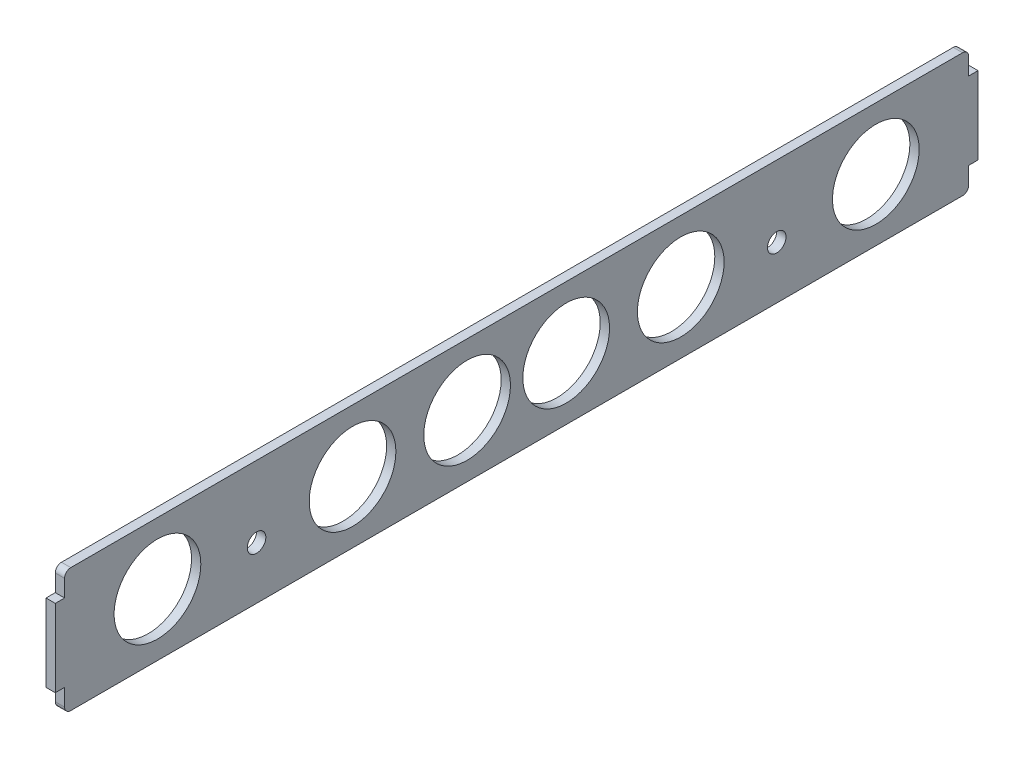
ISO-10303-21;
HEADER;
FILE_DESCRIPTION(('STEP AP214'),'2;1');
FILE_NAME('part.step','',(''),(''),'','','');
FILE_SCHEMA(('AUTOMOTIVE_DESIGN { 1 0 10303 214 1 1 1 1 }'));
ENDSEC;
DATA;
#1=APPLICATION_CONTEXT('core data for automotive mechanical design processes');
#2=APPLICATION_PROTOCOL_DEFINITION('international standard','automotive_design',2000,#1);
#3=PRODUCT_CONTEXT('',#1,'mechanical');
#4=PRODUCT('Part','Part','',(#3));
#5=PRODUCT_RELATED_PRODUCT_CATEGORY('part','',(#4));
#6=PRODUCT_DEFINITION_FORMATION('','',#4);
#7=PRODUCT_DEFINITION_CONTEXT('part definition',#1,'design');
#8=PRODUCT_DEFINITION('design','',#6,#7);
#9=PRODUCT_DEFINITION_SHAPE('','',#8);
#10=(LENGTH_UNIT() NAMED_UNIT(*) SI_UNIT(.MILLI.,.METRE.));
#11=(NAMED_UNIT(*) PLANE_ANGLE_UNIT() SI_UNIT($,.RADIAN.));
#12=(NAMED_UNIT(*) SI_UNIT($,.STERADIAN.) SOLID_ANGLE_UNIT());
#13=UNCERTAINTY_MEASURE_WITH_UNIT(LENGTH_MEASURE(1.E-05),#10,'distance_accuracy_value','');
#14=(GEOMETRIC_REPRESENTATION_CONTEXT(3) GLOBAL_UNCERTAINTY_ASSIGNED_CONTEXT((#13)) GLOBAL_UNIT_ASSIGNED_CONTEXT((#10,
#11,#12)) REPRESENTATION_CONTEXT('',''));
#15=CARTESIAN_POINT('',(0.,0.,0.));
#16=DIRECTION('',(0.,0.,1.));
#17=DIRECTION('',(1.,0.,0.));
#18=AXIS2_PLACEMENT_3D('',#15,#16,#17);
#19=CARTESIAN_POINT('',(3.,0.,-292.));
#20=DIRECTION('',(0.,0.,-1.));
#21=DIRECTION('',(-1.,0.,0.));
#22=AXIS2_PLACEMENT_3D('',#19,#20,#21);
#23=PLANE('',#22);
#24=DIRECTION('',(1.,0.,0.));
#25=VECTOR('',#24,1.);
#26=CARTESIAN_POINT('',(0.,-7.50000000000001,-292.));
#27=LINE('',#26,#25);
#28=CARTESIAN_POINT('',(0.,-7.50000000000001,-292.));
#29=VERTEX_POINT('',#28);
#30=CARTESIAN_POINT('',(3.,-7.50000000000001,-292.));
#31=VERTEX_POINT('',#30);
#32=EDGE_CURVE('E182',#29,#31,#27,.T.);
#33=ORIENTED_EDGE('',*,*,#32,.F.);
#34=DIRECTION('',(0.,-1.,0.));
#35=VECTOR('',#34,1.);
#36=CARTESIAN_POINT('',(0.,0.,-292.));
#37=LINE('',#36,#35);
#38=CARTESIAN_POINT('',(0.,-2.,-292.));
#39=VERTEX_POINT('',#38);
#40=EDGE_CURVE('E259',#39,#29,#37,.T.);
#41=ORIENTED_EDGE('',*,*,#40,.F.);
#42=DIRECTION('',(-1.,0.,0.));
#43=VECTOR('',#42,1.);
#44=CARTESIAN_POINT('',(3.,-2.,-292.));
#45=LINE('',#44,#43);
#46=CARTESIAN_POINT('',(3.,-2.,-292.));
#47=VERTEX_POINT('',#46);
#48=EDGE_CURVE('E284',#39,#47,#45,.F.);
#49=ORIENTED_EDGE('',*,*,#48,.T.);
#50=DIRECTION('',(0.,-1.,0.));
#51=VECTOR('',#50,1.);
#52=CARTESIAN_POINT('',(3.,0.,-292.));
#53=LINE('',#52,#51);
#54=EDGE_CURVE('E239',#47,#31,#53,.T.);
#55=ORIENTED_EDGE('',*,*,#54,.T.);
#56=EDGE_LOOP('',(#33,#41,#49,#55));
#57=FACE_BOUND('',#56,.T.);
#58=ADVANCED_FACE('F38',(#57),#23,.T.);
#59=CARTESIAN_POINT('',(3.,0.,0.));
#60=DIRECTION('',(0.,0.,-1.));
#61=DIRECTION('',(-1.,0.,0.));
#62=AXIS2_PLACEMENT_3D('',#59,#60,#61);
#63=PLANE('',#62);
#64=DIRECTION('',(0.,-1.,0.));
#65=VECTOR('',#64,1.);
#66=CARTESIAN_POINT('',(3.,0.,0.));
#67=LINE('',#66,#65);
#68=CARTESIAN_POINT('',(3.,-32.5,0.));
#69=VERTEX_POINT('',#68);
#70=CARTESIAN_POINT('',(3.,-38.,0.));
#71=VERTEX_POINT('',#70);
#72=EDGE_CURVE('E62',#69,#71,#67,.T.);
#73=ORIENTED_EDGE('',*,*,#72,.F.);
#74=DIRECTION('',(1.,0.,0.));
#75=VECTOR('',#74,1.);
#76=CARTESIAN_POINT('',(0.,-32.5,0.));
#77=LINE('',#76,#75);
#78=CARTESIAN_POINT('',(0.,-32.5,0.));
#79=VERTEX_POINT('',#78);
#80=EDGE_CURVE('E205',#79,#69,#77,.T.);
#81=ORIENTED_EDGE('',*,*,#80,.F.);
#82=DIRECTION('',(0.,-1.,0.));
#83=VECTOR('',#82,1.);
#84=CARTESIAN_POINT('',(0.,0.,0.));
#85=LINE('',#84,#83);
#86=CARTESIAN_POINT('',(0.,-38.,0.));
#87=VERTEX_POINT('',#86);
#88=EDGE_CURVE('E263',#79,#87,#85,.T.);
#89=ORIENTED_EDGE('',*,*,#88,.T.);
#90=DIRECTION('',(-1.,0.,0.));
#91=VECTOR('',#90,1.);
#92=CARTESIAN_POINT('',(3.,-38.,0.));
#93=LINE('',#92,#91);
#94=EDGE_CURVE('E11',#87,#71,#93,.F.);
#95=ORIENTED_EDGE('',*,*,#94,.T.);
#96=EDGE_LOOP('',(#73,#81,#89,#95));
#97=FACE_BOUND('',#96,.T.);
#98=ADVANCED_FACE('F338',(#97),#63,.F.);
#99=DIRECTION('',(1.,0.,0.));
#100=VECTOR('',#99,1.);
#101=CARTESIAN_POINT('',(0.,-32.5,-292.));
#102=LINE('',#101,#100);
#103=CARTESIAN_POINT('',(0.,-32.5,-292.));
#104=VERTEX_POINT('',#103);
#105=CARTESIAN_POINT('',(3.,-32.5,-292.));
#106=VERTEX_POINT('',#105);
#107=EDGE_CURVE('E163',#104,#106,#102,.T.);
#108=ORIENTED_EDGE('',*,*,#107,.T.);
#109=CARTESIAN_POINT('',(3.,-38.,-292.));
#110=VERTEX_POINT('',#109);
#111=EDGE_CURVE('E238',#106,#110,#53,.T.);
#112=ORIENTED_EDGE('',*,*,#111,.T.);
#113=DIRECTION('',(-1.,0.,0.));
#114=VECTOR('',#113,1.);
#115=CARTESIAN_POINT('',(0.,-38.,-292.));
#116=LINE('',#115,#114);
#117=CARTESIAN_POINT('',(0.,-38.,-292.));
#118=VERTEX_POINT('',#117);
#119=EDGE_CURVE('E281',#110,#118,#116,.T.);
#120=ORIENTED_EDGE('',*,*,#119,.T.);
#121=EDGE_CURVE('E258',#104,#118,#37,.T.);
#122=ORIENTED_EDGE('',*,*,#121,.F.);
#123=EDGE_LOOP('',(#108,#112,#120,#122));
#124=FACE_BOUND('',#123,.T.);
#125=ADVANCED_FACE('F341',(#124),#23,.T.);
#126=CARTESIAN_POINT('',(3.,0.,0.));
#127=DIRECTION('',(0.,1.,0.));
#128=DIRECTION('',(0.,0.,1.));
#129=AXIS2_PLACEMENT_3D('',#126,#127,#128);
#130=PLANE('',#129);
#131=DIRECTION('',(0.,0.,-1.));
#132=VECTOR('',#131,1.);
#133=CARTESIAN_POINT('',(3.,0.,0.));
#134=LINE('',#133,#132);
#135=CARTESIAN_POINT('',(3.,0.,-2.));
#136=VERTEX_POINT('',#135);
#137=CARTESIAN_POINT('',(3.,0.,-290.));
#138=VERTEX_POINT('',#137);
#139=EDGE_CURVE('E242',#136,#138,#134,.T.);
#140=ORIENTED_EDGE('',*,*,#139,.T.);
#141=DIRECTION('',(-1.,0.,0.));
#142=VECTOR('',#141,1.);
#143=CARTESIAN_POINT('',(3.,0.,-290.));
#144=LINE('',#143,#142);
#145=CARTESIAN_POINT('',(0.,0.,-290.));
#146=VERTEX_POINT('',#145);
#147=EDGE_CURVE('E269',#138,#146,#144,.T.);
#148=ORIENTED_EDGE('',*,*,#147,.T.);
#149=DIRECTION('',(0.,0.,-1.));
#150=VECTOR('',#149,1.);
#151=CARTESIAN_POINT('',(0.,0.,0.));
#152=LINE('',#151,#150);
#153=CARTESIAN_POINT('',(0.,0.,-2.));
#154=VERTEX_POINT('',#153);
#155=EDGE_CURVE('E261',#154,#146,#152,.T.);
#156=ORIENTED_EDGE('',*,*,#155,.F.);
#157=DIRECTION('',(-1.,0.,0.));
#158=VECTOR('',#157,1.);
#159=CARTESIAN_POINT('',(3.,0.,-2.));
#160=LINE('',#159,#158);
#161=EDGE_CURVE('E251',#154,#136,#160,.F.);
#162=ORIENTED_EDGE('',*,*,#161,.T.);
#163=EDGE_LOOP('',(#140,#148,#156,#162));
#164=FACE_BOUND('',#163,.T.);
#165=ADVANCED_FACE('F351',(#164),#130,.T.);
#166=CARTESIAN_POINT('',(0.,-2.,0.));
#167=VERTEX_POINT('',#166);
#168=CARTESIAN_POINT('',(0.,-7.5,0.));
#169=VERTEX_POINT('',#168);
#170=EDGE_CURVE('E264',#167,#169,#85,.T.);
#171=ORIENTED_EDGE('',*,*,#170,.T.);
#172=DIRECTION('',(1.,0.,0.));
#173=VECTOR('',#172,1.);
#174=CARTESIAN_POINT('',(0.,-7.5,0.));
#175=LINE('',#174,#173);
#176=CARTESIAN_POINT('',(3.,-7.5,0.));
#177=VERTEX_POINT('',#176);
#178=EDGE_CURVE('E197',#169,#177,#175,.T.);
#179=ORIENTED_EDGE('',*,*,#178,.T.);
#180=CARTESIAN_POINT('',(3.,-2.,0.));
#181=VERTEX_POINT('',#180);
#182=EDGE_CURVE('E245',#181,#177,#67,.T.);
#183=ORIENTED_EDGE('',*,*,#182,.F.);
#184=DIRECTION('',(-1.,0.,0.));
#185=VECTOR('',#184,1.);
#186=CARTESIAN_POINT('',(0.,-2.,0.));
#187=LINE('',#186,#185);
#188=EDGE_CURVE('E47',#181,#167,#187,.T.);
#189=ORIENTED_EDGE('',*,*,#188,.T.);
#190=EDGE_LOOP('',(#171,#179,#183,#189));
#191=FACE_BOUND('',#190,.T.);
#192=ADVANCED_FACE('F346',(#191),#63,.F.);
#193=CARTESIAN_POINT('',(3.,-23.,-62.));
#194=DIRECTION('',(-1.,0.,0.));
#195=DIRECTION('',(0.,0.,1.));
#196=AXIS2_PLACEMENT_3D('',#193,#194,#195);
#197=CYLINDRICAL_SURFACE('',#196,3.00000000000001);
#198=CARTESIAN_POINT('',(3.,-23.,-62.));
#199=DIRECTION('',(1.,0.,0.));
#200=DIRECTION('',(0.,0.,-1.));
#201=AXIS2_PLACEMENT_3D('',#198,#199,#200);
#202=CIRCLE('',#201,3.00000000000001);
#203=CARTESIAN_POINT('',(3.,-23.,-65.));
#204=VERTEX_POINT('',#203);
#205=EDGE_CURVE('E234',#204,#204,#202,.T.);
#206=ORIENTED_EDGE('',*,*,#205,.T.);
#207=EDGE_LOOP('',(#206));
#208=FACE_BOUND('',#207,.T.);
#209=CARTESIAN_POINT('',(0.,-23.,-62.));
#210=DIRECTION('',(1.,0.,0.));
#211=DIRECTION('',(0.,0.,-1.));
#212=AXIS2_PLACEMENT_3D('',#209,#210,#211);
#213=CIRCLE('',#212,3.00000000000001);
#214=CARTESIAN_POINT('',(0.,-23.,-65.));
#215=VERTEX_POINT('',#214);
#216=EDGE_CURVE('E255',#215,#215,#213,.T.);
#217=ORIENTED_EDGE('',*,*,#216,.F.);
#218=EDGE_LOOP('',(#217));
#219=FACE_BOUND('',#218,.T.);
#220=ADVANCED_FACE('F477',(#208,#219),#197,.F.);
#221=CARTESIAN_POINT('',(3.,-23.,-230.));
#222=DIRECTION('',(-1.,0.,0.));
#223=DIRECTION('',(0.,0.,1.));
#224=AXIS2_PLACEMENT_3D('',#221,#222,#223);
#225=CYLINDRICAL_SURFACE('',#224,2.99999999999999);
#226=CARTESIAN_POINT('',(3.,-23.,-230.));
#227=DIRECTION('',(1.,0.,0.));
#228=DIRECTION('',(0.,0.,-1.));
#229=AXIS2_PLACEMENT_3D('',#226,#227,#228);
#230=CIRCLE('',#229,2.99999999999999);
#231=CARTESIAN_POINT('',(3.,-23.,-233.));
#232=VERTEX_POINT('',#231);
#233=EDGE_CURVE('E231',#232,#232,#230,.T.);
#234=ORIENTED_EDGE('',*,*,#233,.T.);
#235=EDGE_LOOP('',(#234));
#236=FACE_BOUND('',#235,.T.);
#237=CARTESIAN_POINT('',(0.,-23.,-230.));
#238=DIRECTION('',(1.,0.,0.));
#239=DIRECTION('',(0.,0.,-1.));
#240=AXIS2_PLACEMENT_3D('',#237,#238,#239);
#241=CIRCLE('',#240,2.99999999999999);
#242=CARTESIAN_POINT('',(0.,-23.,-233.));
#243=VERTEX_POINT('',#242);
#244=EDGE_CURVE('E252',#243,#243,#241,.T.);
#245=ORIENTED_EDGE('',*,*,#244,.F.);
#246=EDGE_LOOP('',(#245));
#247=FACE_BOUND('',#246,.T.);
#248=ADVANCED_FACE('F580',(#236,#247),#225,.F.);
#249=CARTESIAN_POINT('',(3.,-40.,0.));
#250=DIRECTION('',(0.,1.,0.));
#251=DIRECTION('',(0.,0.,1.));
#252=AXIS2_PLACEMENT_3D('',#249,#250,#251);
#253=PLANE('',#252);
#254=DIRECTION('',(0.,0.,-1.));
#255=VECTOR('',#254,1.);
#256=CARTESIAN_POINT('',(0.,-40.,0.));
#257=LINE('',#256,#255);
#258=CARTESIAN_POINT('',(0.,-40.,-2.));
#259=VERTEX_POINT('',#258);
#260=CARTESIAN_POINT('',(0.,-40.,-290.));
#261=VERTEX_POINT('',#260);
#262=EDGE_CURVE('E235',#259,#261,#257,.T.);
#263=ORIENTED_EDGE('',*,*,#262,.T.);
#264=DIRECTION('',(-1.,0.,0.));
#265=VECTOR('',#264,1.);
#266=CARTESIAN_POINT('',(3.,-40.,-290.));
#267=LINE('',#266,#265);
#268=CARTESIAN_POINT('',(3.,-40.,-290.));
#269=VERTEX_POINT('',#268);
#270=EDGE_CURVE('E298',#261,#269,#267,.F.);
#271=ORIENTED_EDGE('',*,*,#270,.T.);
#272=DIRECTION('',(0.,0.,-1.));
#273=VECTOR('',#272,1.);
#274=CARTESIAN_POINT('',(3.,-40.,0.));
#275=LINE('',#274,#273);
#276=CARTESIAN_POINT('',(3.,-40.,-2.));
#277=VERTEX_POINT('',#276);
#278=EDGE_CURVE('E248',#277,#269,#275,.T.);
#279=ORIENTED_EDGE('',*,*,#278,.F.);
#280=DIRECTION('',(-1.,0.,0.));
#281=VECTOR('',#280,1.);
#282=CARTESIAN_POINT('',(3.,-40.,-2.));
#283=LINE('',#282,#281);
#284=EDGE_CURVE('E295',#277,#259,#283,.T.);
#285=ORIENTED_EDGE('',*,*,#284,.T.);
#286=EDGE_LOOP('',(#263,#271,#279,#285));
#287=FACE_BOUND('',#286,.T.);
#288=ADVANCED_FACE('F370',(#287),#253,.F.);
#289=CARTESIAN_POINT('',(3.,0.,0.));
#290=DIRECTION('',(1.,0.,0.));
#291=DIRECTION('',(0.,0.,-1.));
#292=AXIS2_PLACEMENT_3D('',#289,#290,#291);
#293=PLANE('',#292);
#294=CARTESIAN_POINT('',(3.,-20.,-30.));
#295=DIRECTION('',(1.,0.,0.));
#296=DIRECTION('',(0.,0.,-1.));
#297=AXIS2_PLACEMENT_3D('',#294,#295,#296);
#298=CIRCLE('',#297,14.);
#299=CARTESIAN_POINT('',(3.,-20.,-44.));
#300=VERTEX_POINT('',#299);
#301=EDGE_CURVE('E213',#300,#300,#298,.T.);
#302=ORIENTED_EDGE('',*,*,#301,.F.);
#303=EDGE_LOOP('',(#302));
#304=FACE_BOUND('',#303,.T.);
#305=CARTESIAN_POINT('',(3.,-20.,-93.));
#306=DIRECTION('',(1.,0.,0.));
#307=DIRECTION('',(0.,0.,-1.));
#308=AXIS2_PLACEMENT_3D('',#305,#306,#307);
#309=CIRCLE('',#308,14.);
#310=CARTESIAN_POINT('',(3.,-20.,-107.));
#311=VERTEX_POINT('',#310);
#312=EDGE_CURVE('E217',#311,#311,#309,.T.);
#313=ORIENTED_EDGE('',*,*,#312,.F.);
#314=EDGE_LOOP('',(#313));
#315=FACE_BOUND('',#314,.T.);
#316=CARTESIAN_POINT('',(3.,-20.,-130.));
#317=DIRECTION('',(1.,0.,0.));
#318=DIRECTION('',(0.,0.,-1.));
#319=AXIS2_PLACEMENT_3D('',#316,#317,#318);
#320=CIRCLE('',#319,14.);
#321=CARTESIAN_POINT('',(3.,-20.,-144.));
#322=VERTEX_POINT('',#321);
#323=EDGE_CURVE('E220',#322,#322,#320,.T.);
#324=ORIENTED_EDGE('',*,*,#323,.F.);
#325=EDGE_LOOP('',(#324));
#326=FACE_BOUND('',#325,.T.);
#327=CARTESIAN_POINT('',(3.,-20.,-199.));
#328=DIRECTION('',(1.,0.,0.));
#329=DIRECTION('',(0.,0.,-1.));
#330=AXIS2_PLACEMENT_3D('',#327,#328,#329);
#331=CIRCLE('',#330,14.);
#332=CARTESIAN_POINT('',(3.,-20.,-213.));
#333=VERTEX_POINT('',#332);
#334=EDGE_CURVE('E223',#333,#333,#331,.T.);
#335=ORIENTED_EDGE('',*,*,#334,.F.);
#336=EDGE_LOOP('',(#335));
#337=FACE_BOUND('',#336,.T.);
#338=CARTESIAN_POINT('',(3.,-20.,-162.));
#339=DIRECTION('',(1.,0.,0.));
#340=DIRECTION('',(0.,0.,-1.));
#341=AXIS2_PLACEMENT_3D('',#338,#339,#340);
#342=CIRCLE('',#341,14.);
#343=CARTESIAN_POINT('',(3.,-20.,-176.));
#344=VERTEX_POINT('',#343);
#345=EDGE_CURVE('E226',#344,#344,#342,.T.);
#346=ORIENTED_EDGE('',*,*,#345,.F.);
#347=EDGE_LOOP('',(#346));
#348=FACE_BOUND('',#347,.T.);
#349=CARTESIAN_POINT('',(3.,-20.,-262.));
#350=DIRECTION('',(1.,0.,0.));
#351=DIRECTION('',(0.,0.,-1.));
#352=AXIS2_PLACEMENT_3D('',#349,#350,#351);
#353=CIRCLE('',#352,14.);
#354=CARTESIAN_POINT('',(3.,-20.,-276.));
#355=VERTEX_POINT('',#354);
#356=EDGE_CURVE('E207',#355,#355,#353,.T.);
#357=ORIENTED_EDGE('',*,*,#356,.F.);
#358=EDGE_LOOP('',(#357));
#359=FACE_BOUND('',#358,.T.);
#360=ORIENTED_EDGE('',*,*,#233,.F.);
#361=EDGE_LOOP('',(#360));
#362=FACE_BOUND('',#361,.T.);
#363=ORIENTED_EDGE('',*,*,#205,.F.);
#364=EDGE_LOOP('',(#363));
#365=FACE_BOUND('',#364,.T.);
#366=ORIENTED_EDGE('',*,*,#54,.F.);
#367=CARTESIAN_POINT('',(3.,-2.,-290.));
#368=DIRECTION('',(1.,0.,0.));
#369=DIRECTION('',(0.,0.,-1.));
#370=AXIS2_PLACEMENT_3D('',#367,#368,#369);
#371=CIRCLE('',#370,2.);
#372=EDGE_CURVE('E293',#47,#138,#371,.T.);
#373=ORIENTED_EDGE('',*,*,#372,.T.);
#374=ORIENTED_EDGE('',*,*,#139,.F.);
#375=CARTESIAN_POINT('',(3.,-2.,-2.));
#376=DIRECTION('',(1.,0.,0.));
#377=DIRECTION('',(0.,0.,-1.));
#378=AXIS2_PLACEMENT_3D('',#375,#376,#377);
#379=CIRCLE('',#378,2.);
#380=EDGE_CURVE('E286',#136,#181,#379,.T.);
#381=ORIENTED_EDGE('',*,*,#380,.T.);
#382=ORIENTED_EDGE('',*,*,#182,.T.);
#383=DIRECTION('',(0.,0.,1.));
#384=VECTOR('',#383,1.);
#385=CARTESIAN_POINT('',(3.,-7.5,0.));
#386=LINE('',#385,#384);
#387=CARTESIAN_POINT('',(3.,-7.5,2.99999999999999));
#388=VERTEX_POINT('',#387);
#389=EDGE_CURVE('E184',#177,#388,#386,.T.);
#390=ORIENTED_EDGE('',*,*,#389,.T.);
#391=DIRECTION('',(0.,-1.,0.));
#392=VECTOR('',#391,1.);
#393=CARTESIAN_POINT('',(3.,-7.5,2.99999999999999));
#394=LINE('',#393,#392);
#395=CARTESIAN_POINT('',(3.,-32.5,3.));
#396=VERTEX_POINT('',#395);
#397=EDGE_CURVE('E200',#388,#396,#394,.T.);
#398=ORIENTED_EDGE('',*,*,#397,.T.);
#399=DIRECTION('',(0.,0.,-1.));
#400=VECTOR('',#399,1.);
#401=CARTESIAN_POINT('',(3.,-32.5,0.));
#402=LINE('',#401,#400);
#403=EDGE_CURVE('E191',#396,#69,#402,.T.);
#404=ORIENTED_EDGE('',*,*,#403,.T.);
#405=ORIENTED_EDGE('',*,*,#72,.T.);
#406=CARTESIAN_POINT('',(3.,-38.,-2.));
#407=DIRECTION('',(1.,0.,0.));
#408=DIRECTION('',(0.,0.,-1.));
#409=AXIS2_PLACEMENT_3D('',#406,#407,#408);
#410=CIRCLE('',#409,2.);
#411=EDGE_CURVE('E288',#71,#277,#410,.T.);
#412=ORIENTED_EDGE('',*,*,#411,.T.);
#413=ORIENTED_EDGE('',*,*,#278,.T.);
#414=CARTESIAN_POINT('',(3.,-38.,-290.));
#415=DIRECTION('',(1.,0.,0.));
#416=DIRECTION('',(0.,0.,-1.));
#417=AXIS2_PLACEMENT_3D('',#414,#415,#416);
#418=CIRCLE('',#417,2.);
#419=EDGE_CURVE('E290',#269,#110,#418,.T.);
#420=ORIENTED_EDGE('',*,*,#419,.T.);
#421=ORIENTED_EDGE('',*,*,#111,.F.);
#422=DIRECTION('',(0.,0.,-1.));
#423=VECTOR('',#422,1.);
#424=CARTESIAN_POINT('',(3.,-32.5,-292.));
#425=LINE('',#424,#423);
#426=CARTESIAN_POINT('',(3.,-32.5,-295.));
#427=VERTEX_POINT('',#426);
#428=EDGE_CURVE('E179',#106,#427,#425,.T.);
#429=ORIENTED_EDGE('',*,*,#428,.T.);
#430=DIRECTION('',(0.,1.,0.));
#431=VECTOR('',#430,1.);
#432=CARTESIAN_POINT('',(3.,-7.5,-295.));
#433=LINE('',#432,#431);
#434=CARTESIAN_POINT('',(3.,-7.5,-295.));
#435=VERTEX_POINT('',#434);
#436=EDGE_CURVE('E159',#427,#435,#433,.T.);
#437=ORIENTED_EDGE('',*,*,#436,.T.);
#438=DIRECTION('',(0.,0.,1.));
#439=VECTOR('',#438,1.);
#440=CARTESIAN_POINT('',(3.,-7.50000000000001,-292.));
#441=LINE('',#440,#439);
#442=EDGE_CURVE('E173',#435,#31,#441,.T.);
#443=ORIENTED_EDGE('',*,*,#442,.T.);
#444=EDGE_LOOP('',(#366,#373,#374,#381,#382,#390,#398,#404,#405,#412,#413,#420,#421,#429,#437,#443));
#445=FACE_BOUND('',#444,.T.);
#446=ADVANCED_FACE('F360',(#304,#315,#326,#337,#348,#359,#362,#365,#445),#293,.T.);
#447=CARTESIAN_POINT('',(0.,0.,0.));
#448=DIRECTION('',(1.,0.,0.));
#449=DIRECTION('',(0.,0.,-1.));
#450=AXIS2_PLACEMENT_3D('',#447,#448,#449);
#451=PLANE('',#450);
#452=CARTESIAN_POINT('',(0.,-20.,-30.));
#453=DIRECTION('',(1.,0.,0.));
#454=DIRECTION('',(0.,0.,-1.));
#455=AXIS2_PLACEMENT_3D('',#452,#453,#454);
#456=CIRCLE('',#455,14.);
#457=CARTESIAN_POINT('',(0.,-20.,-44.));
#458=VERTEX_POINT('',#457);
#459=EDGE_CURVE('E42',#458,#458,#456,.T.);
#460=ORIENTED_EDGE('',*,*,#459,.T.);
#461=EDGE_LOOP('',(#460));
#462=FACE_BOUND('',#461,.T.);
#463=CARTESIAN_POINT('',(0.,-20.,-93.));
#464=DIRECTION('',(1.,0.,0.));
#465=DIRECTION('',(0.,0.,-1.));
#466=AXIS2_PLACEMENT_3D('',#463,#464,#465);
#467=CIRCLE('',#466,14.);
#468=CARTESIAN_POINT('',(0.,-20.,-107.));
#469=VERTEX_POINT('',#468);
#470=EDGE_CURVE('E312',#469,#469,#467,.T.);
#471=ORIENTED_EDGE('',*,*,#470,.T.);
#472=EDGE_LOOP('',(#471));
#473=FACE_BOUND('',#472,.T.);
#474=CARTESIAN_POINT('',(0.,-20.,-130.));
#475=DIRECTION('',(1.,0.,0.));
#476=DIRECTION('',(0.,0.,-1.));
#477=AXIS2_PLACEMENT_3D('',#474,#475,#476);
#478=CIRCLE('',#477,14.);
#479=CARTESIAN_POINT('',(0.,-20.,-144.));
#480=VERTEX_POINT('',#479);
#481=EDGE_CURVE('E310',#480,#480,#478,.T.);
#482=ORIENTED_EDGE('',*,*,#481,.T.);
#483=EDGE_LOOP('',(#482));
#484=FACE_BOUND('',#483,.T.);
#485=CARTESIAN_POINT('',(0.,-20.,-199.));
#486=DIRECTION('',(1.,0.,0.));
#487=DIRECTION('',(0.,0.,-1.));
#488=AXIS2_PLACEMENT_3D('',#485,#486,#487);
#489=CIRCLE('',#488,14.);
#490=CARTESIAN_POINT('',(0.,-20.,-213.));
#491=VERTEX_POINT('',#490);
#492=EDGE_CURVE('E307',#491,#491,#489,.T.);
#493=ORIENTED_EDGE('',*,*,#492,.T.);
#494=EDGE_LOOP('',(#493));
#495=FACE_BOUND('',#494,.T.);
#496=CARTESIAN_POINT('',(0.,-20.,-162.));
#497=DIRECTION('',(1.,0.,0.));
#498=DIRECTION('',(0.,0.,-1.));
#499=AXIS2_PLACEMENT_3D('',#496,#497,#498);
#500=CIRCLE('',#499,14.);
#501=CARTESIAN_POINT('',(0.,-20.,-176.));
#502=VERTEX_POINT('',#501);
#503=EDGE_CURVE('E304',#502,#502,#500,.T.);
#504=ORIENTED_EDGE('',*,*,#503,.T.);
#505=EDGE_LOOP('',(#504));
#506=FACE_BOUND('',#505,.T.);
#507=CARTESIAN_POINT('',(0.,-20.,-262.));
#508=DIRECTION('',(1.,0.,0.));
#509=DIRECTION('',(0.,0.,-1.));
#510=AXIS2_PLACEMENT_3D('',#507,#508,#509);
#511=CIRCLE('',#510,14.);
#512=CARTESIAN_POINT('',(0.,-20.,-276.));
#513=VERTEX_POINT('',#512);
#514=EDGE_CURVE('E216',#513,#513,#511,.T.);
#515=ORIENTED_EDGE('',*,*,#514,.T.);
#516=EDGE_LOOP('',(#515));
#517=FACE_BOUND('',#516,.T.);
#518=ORIENTED_EDGE('',*,*,#244,.T.);
#519=EDGE_LOOP('',(#518));
#520=FACE_BOUND('',#519,.T.);
#521=ORIENTED_EDGE('',*,*,#216,.T.);
#522=EDGE_LOOP('',(#521));
#523=FACE_BOUND('',#522,.T.);
#524=ORIENTED_EDGE('',*,*,#155,.T.);
#525=CARTESIAN_POINT('',(0.,-2.,-290.));
#526=DIRECTION('',(1.,0.,0.));
#527=DIRECTION('',(0.,0.,-1.));
#528=AXIS2_PLACEMENT_3D('',#525,#526,#527);
#529=CIRCLE('',#528,2.);
#530=EDGE_CURVE('E279',#146,#39,#529,.F.);
#531=ORIENTED_EDGE('',*,*,#530,.T.);
#532=ORIENTED_EDGE('',*,*,#40,.T.);
#533=DIRECTION('',(0.,0.,1.));
#534=VECTOR('',#533,1.);
#535=CARTESIAN_POINT('',(0.,-7.50000000000001,-292.));
#536=LINE('',#535,#534);
#537=CARTESIAN_POINT('',(0.,-7.5,-295.));
#538=VERTEX_POINT('',#537);
#539=EDGE_CURVE('E168',#538,#29,#536,.T.);
#540=ORIENTED_EDGE('',*,*,#539,.F.);
#541=DIRECTION('',(0.,1.,0.));
#542=VECTOR('',#541,1.);
#543=CARTESIAN_POINT('',(0.,-7.5,-295.));
#544=LINE('',#543,#542);
#545=CARTESIAN_POINT('',(0.,-32.5,-295.));
#546=VERTEX_POINT('',#545);
#547=EDGE_CURVE('E156',#546,#538,#544,.T.);
#548=ORIENTED_EDGE('',*,*,#547,.F.);
#549=DIRECTION('',(0.,0.,-1.));
#550=VECTOR('',#549,1.);
#551=CARTESIAN_POINT('',(0.,-32.5,-292.));
#552=LINE('',#551,#550);
#553=EDGE_CURVE('E55',#104,#546,#552,.T.);
#554=ORIENTED_EDGE('',*,*,#553,.F.);
#555=ORIENTED_EDGE('',*,*,#121,.T.);
#556=CARTESIAN_POINT('',(0.,-38.,-290.));
#557=DIRECTION('',(1.,0.,0.));
#558=DIRECTION('',(0.,0.,-1.));
#559=AXIS2_PLACEMENT_3D('',#556,#557,#558);
#560=CIRCLE('',#559,2.);
#561=EDGE_CURVE('E277',#118,#261,#560,.F.);
#562=ORIENTED_EDGE('',*,*,#561,.T.);
#563=ORIENTED_EDGE('',*,*,#262,.F.);
#564=CARTESIAN_POINT('',(0.,-38.,-2.));
#565=DIRECTION('',(1.,0.,0.));
#566=DIRECTION('',(0.,0.,-1.));
#567=AXIS2_PLACEMENT_3D('',#564,#565,#566);
#568=CIRCLE('',#567,2.);
#569=EDGE_CURVE('E274',#259,#87,#568,.F.);
#570=ORIENTED_EDGE('',*,*,#569,.T.);
#571=ORIENTED_EDGE('',*,*,#88,.F.);
#572=DIRECTION('',(0.,0.,-1.));
#573=VECTOR('',#572,1.);
#574=CARTESIAN_POINT('',(0.,-32.5,0.));
#575=LINE('',#574,#573);
#576=CARTESIAN_POINT('',(0.,-32.5,3.));
#577=VERTEX_POINT('',#576);
#578=EDGE_CURVE('E194',#577,#79,#575,.T.);
#579=ORIENTED_EDGE('',*,*,#578,.F.);
#580=DIRECTION('',(0.,-1.,0.));
#581=VECTOR('',#580,1.);
#582=CARTESIAN_POINT('',(0.,-7.5,2.99999999999999));
#583=LINE('',#582,#581);
#584=CARTESIAN_POINT('',(0.,-7.5,2.99999999999999));
#585=VERTEX_POINT('',#584);
#586=EDGE_CURVE('E190',#585,#577,#583,.T.);
#587=ORIENTED_EDGE('',*,*,#586,.F.);
#588=DIRECTION('',(0.,0.,1.));
#589=VECTOR('',#588,1.);
#590=CARTESIAN_POINT('',(0.,-7.5,0.));
#591=LINE('',#590,#589);
#592=EDGE_CURVE('E187',#169,#585,#591,.T.);
#593=ORIENTED_EDGE('',*,*,#592,.F.);
#594=ORIENTED_EDGE('',*,*,#170,.F.);
#595=CARTESIAN_POINT('',(0.,-2.,-2.));
#596=DIRECTION('',(1.,0.,0.));
#597=DIRECTION('',(0.,0.,-1.));
#598=AXIS2_PLACEMENT_3D('',#595,#596,#597);
#599=CIRCLE('',#598,2.);
#600=EDGE_CURVE('E272',#167,#154,#599,.F.);
#601=ORIENTED_EDGE('',*,*,#600,.T.);
#602=EDGE_LOOP('',(#524,#531,#532,#540,#548,#554,#555,#562,#563,#570,#571,#579,#587,#593,#594,#601));
#603=FACE_BOUND('',#602,.T.);
#604=ADVANCED_FACE('F166',(#462,#473,#484,#495,#506,#517,#520,#523,#603),#451,.F.);
#605=CARTESIAN_POINT('',(3.,-2.,-290.));
#606=DIRECTION('',(-1.,0.,0.));
#607=DIRECTION('',(0.,0.,1.));
#608=AXIS2_PLACEMENT_3D('',#605,#606,#607);
#609=CYLINDRICAL_SURFACE('',#608,2.);
#610=ORIENTED_EDGE('',*,*,#372,.F.);
#611=ORIENTED_EDGE('',*,*,#48,.F.);
#612=ORIENTED_EDGE('',*,*,#530,.F.);
#613=ORIENTED_EDGE('',*,*,#147,.F.);
#614=EDGE_LOOP('',(#610,#611,#612,#613));
#615=FACE_BOUND('',#614,.T.);
#616=ADVANCED_FACE('F398',(#615),#609,.T.);
#617=CARTESIAN_POINT('',(3.,-38.,-290.));
#618=DIRECTION('',(1.,0.,0.));
#619=DIRECTION('',(0.,0.,-1.));
#620=AXIS2_PLACEMENT_3D('',#617,#618,#619);
#621=CYLINDRICAL_SURFACE('',#620,2.);
#622=ORIENTED_EDGE('',*,*,#419,.F.);
#623=ORIENTED_EDGE('',*,*,#270,.F.);
#624=ORIENTED_EDGE('',*,*,#561,.F.);
#625=ORIENTED_EDGE('',*,*,#119,.F.);
#626=EDGE_LOOP('',(#622,#623,#624,#625));
#627=FACE_BOUND('',#626,.T.);
#628=ADVANCED_FACE('F367',(#627),#621,.T.);
#629=CARTESIAN_POINT('',(3.,-38.,-2.));
#630=DIRECTION('',(-1.,0.,0.));
#631=DIRECTION('',(0.,0.,1.));
#632=AXIS2_PLACEMENT_3D('',#629,#630,#631);
#633=CYLINDRICAL_SURFACE('',#632,2.);
#634=ORIENTED_EDGE('',*,*,#411,.F.);
#635=ORIENTED_EDGE('',*,*,#94,.F.);
#636=ORIENTED_EDGE('',*,*,#569,.F.);
#637=ORIENTED_EDGE('',*,*,#284,.F.);
#638=EDGE_LOOP('',(#634,#635,#636,#637));
#639=FACE_BOUND('',#638,.T.);
#640=ADVANCED_FACE('F374',(#639),#633,.T.);
#641=CARTESIAN_POINT('',(3.,-2.,-2.));
#642=DIRECTION('',(1.,0.,0.));
#643=DIRECTION('',(0.,0.,-1.));
#644=AXIS2_PLACEMENT_3D('',#641,#642,#643);
#645=CYLINDRICAL_SURFACE('',#644,2.);
#646=ORIENTED_EDGE('',*,*,#380,.F.);
#647=ORIENTED_EDGE('',*,*,#161,.F.);
#648=ORIENTED_EDGE('',*,*,#600,.F.);
#649=ORIENTED_EDGE('',*,*,#188,.F.);
#650=EDGE_LOOP('',(#646,#647,#648,#649));
#651=FACE_BOUND('',#650,.T.);
#652=ADVANCED_FACE('F40',(#651),#645,.T.);
#653=CARTESIAN_POINT('',(-7.,-20.,-262.));
#654=DIRECTION('',(1.,0.,0.));
#655=DIRECTION('',(0.,0.,-1.));
#656=AXIS2_PLACEMENT_3D('',#653,#654,#655);
#657=CYLINDRICAL_SURFACE('',#656,14.);
#658=ORIENTED_EDGE('',*,*,#356,.T.);
#659=EDGE_LOOP('',(#658));
#660=FACE_BOUND('',#659,.T.);
#661=ORIENTED_EDGE('',*,*,#514,.F.);
#662=EDGE_LOOP('',(#661));
#663=FACE_BOUND('',#662,.T.);
#664=ADVANCED_FACE('F533',(#660,#663),#657,.F.);
#665=CARTESIAN_POINT('',(-7.,-20.,-162.));
#666=DIRECTION('',(1.,0.,0.));
#667=DIRECTION('',(0.,0.,-1.));
#668=AXIS2_PLACEMENT_3D('',#665,#666,#667);
#669=CYLINDRICAL_SURFACE('',#668,14.);
#670=ORIENTED_EDGE('',*,*,#345,.T.);
#671=EDGE_LOOP('',(#670));
#672=FACE_BOUND('',#671,.T.);
#673=ORIENTED_EDGE('',*,*,#503,.F.);
#674=EDGE_LOOP('',(#673));
#675=FACE_BOUND('',#674,.T.);
#676=ADVANCED_FACE('F523',(#672,#675),#669,.F.);
#677=CARTESIAN_POINT('',(-7.,-20.,-199.));
#678=DIRECTION('',(1.,0.,0.));
#679=DIRECTION('',(0.,0.,-1.));
#680=AXIS2_PLACEMENT_3D('',#677,#678,#679);
#681=CYLINDRICAL_SURFACE('',#680,14.);
#682=ORIENTED_EDGE('',*,*,#334,.T.);
#683=EDGE_LOOP('',(#682));
#684=FACE_BOUND('',#683,.T.);
#685=ORIENTED_EDGE('',*,*,#492,.F.);
#686=EDGE_LOOP('',(#685));
#687=FACE_BOUND('',#686,.T.);
#688=ADVANCED_FACE('F513',(#684,#687),#681,.F.);
#689=CARTESIAN_POINT('',(-7.,-20.,-130.));
#690=DIRECTION('',(1.,0.,0.));
#691=DIRECTION('',(0.,0.,-1.));
#692=AXIS2_PLACEMENT_3D('',#689,#690,#691);
#693=CYLINDRICAL_SURFACE('',#692,14.);
#694=ORIENTED_EDGE('',*,*,#323,.T.);
#695=EDGE_LOOP('',(#694));
#696=FACE_BOUND('',#695,.T.);
#697=ORIENTED_EDGE('',*,*,#481,.F.);
#698=EDGE_LOOP('',(#697));
#699=FACE_BOUND('',#698,.T.);
#700=ADVANCED_FACE('F333',(#696,#699),#693,.F.);
#701=CARTESIAN_POINT('',(-7.,-20.,-93.));
#702=DIRECTION('',(1.,0.,0.));
#703=DIRECTION('',(0.,0.,-1.));
#704=AXIS2_PLACEMENT_3D('',#701,#702,#703);
#705=CYLINDRICAL_SURFACE('',#704,14.);
#706=ORIENTED_EDGE('',*,*,#312,.T.);
#707=EDGE_LOOP('',(#706));
#708=FACE_BOUND('',#707,.T.);
#709=ORIENTED_EDGE('',*,*,#470,.F.);
#710=EDGE_LOOP('',(#709));
#711=FACE_BOUND('',#710,.T.);
#712=ADVANCED_FACE('F323',(#708,#711),#705,.F.);
#713=CARTESIAN_POINT('',(-7.,-20.,-30.));
#714=DIRECTION('',(1.,0.,0.));
#715=DIRECTION('',(0.,0.,-1.));
#716=AXIS2_PLACEMENT_3D('',#713,#714,#715);
#717=CYLINDRICAL_SURFACE('',#716,14.);
#718=ORIENTED_EDGE('',*,*,#301,.T.);
#719=EDGE_LOOP('',(#718));
#720=FACE_BOUND('',#719,.T.);
#721=ORIENTED_EDGE('',*,*,#459,.F.);
#722=EDGE_LOOP('',(#721));
#723=FACE_BOUND('',#722,.T.);
#724=ADVANCED_FACE('F320',(#720,#723),#717,.F.);
#725=CARTESIAN_POINT('',(0.,-32.5,0.));
#726=DIRECTION('',(0.,-1.,0.));
#727=DIRECTION('',(0.,0.,-1.));
#728=AXIS2_PLACEMENT_3D('',#725,#726,#727);
#729=PLANE('',#728);
#730=ORIENTED_EDGE('',*,*,#403,.F.);
#731=DIRECTION('',(1.,0.,0.));
#732=VECTOR('',#731,1.);
#733=CARTESIAN_POINT('',(0.,-32.5,3.));
#734=LINE('',#733,#732);
#735=EDGE_CURVE('E208',#577,#396,#734,.T.);
#736=ORIENTED_EDGE('',*,*,#735,.F.);
#737=ORIENTED_EDGE('',*,*,#578,.T.);
#738=ORIENTED_EDGE('',*,*,#80,.T.);
#739=EDGE_LOOP('',(#730,#736,#737,#738));
#740=FACE_BOUND('',#739,.T.);
#741=ADVANCED_FACE('F322',(#740),#729,.T.);
#742=CARTESIAN_POINT('',(0.,-7.5,2.99999999999999));
#743=DIRECTION('',(0.,0.,1.));
#744=DIRECTION('',(0.,-1.,0.));
#745=AXIS2_PLACEMENT_3D('',#742,#743,#744);
#746=PLANE('',#745);
#747=ORIENTED_EDGE('',*,*,#397,.F.);
#748=DIRECTION('',(1.,0.,0.));
#749=VECTOR('',#748,1.);
#750=CARTESIAN_POINT('',(0.,-7.5,2.99999999999999));
#751=LINE('',#750,#749);
#752=EDGE_CURVE('E210',#585,#388,#751,.T.);
#753=ORIENTED_EDGE('',*,*,#752,.F.);
#754=ORIENTED_EDGE('',*,*,#586,.T.);
#755=ORIENTED_EDGE('',*,*,#735,.T.);
#756=EDGE_LOOP('',(#747,#753,#754,#755));
#757=FACE_BOUND('',#756,.T.);
#758=ADVANCED_FACE('F330',(#757),#746,.T.);
#759=CARTESIAN_POINT('',(0.,-7.5,0.));
#760=DIRECTION('',(0.,1.,0.));
#761=DIRECTION('',(0.,0.,1.));
#762=AXIS2_PLACEMENT_3D('',#759,#760,#761);
#763=PLANE('',#762);
#764=ORIENTED_EDGE('',*,*,#389,.F.);
#765=ORIENTED_EDGE('',*,*,#178,.F.);
#766=ORIENTED_EDGE('',*,*,#592,.T.);
#767=ORIENTED_EDGE('',*,*,#752,.T.);
#768=EDGE_LOOP('',(#764,#765,#766,#767));
#769=FACE_BOUND('',#768,.T.);
#770=ADVANCED_FACE('F386',(#769),#763,.T.);
#771=CARTESIAN_POINT('',(0.,-7.50000000000001,-292.));
#772=DIRECTION('',(0.,1.,0.));
#773=DIRECTION('',(0.,0.,1.));
#774=AXIS2_PLACEMENT_3D('',#771,#772,#773);
#775=PLANE('',#774);
#776=ORIENTED_EDGE('',*,*,#442,.F.);
#777=DIRECTION('',(1.,0.,0.));
#778=VECTOR('',#777,1.);
#779=CARTESIAN_POINT('',(0.,-7.5,-295.));
#780=LINE('',#779,#778);
#781=EDGE_CURVE('E162',#538,#435,#780,.T.);
#782=ORIENTED_EDGE('',*,*,#781,.F.);
#783=ORIENTED_EDGE('',*,*,#539,.T.);
#784=ORIENTED_EDGE('',*,*,#32,.T.);
#785=EDGE_LOOP('',(#776,#782,#783,#784));
#786=FACE_BOUND('',#785,.T.);
#787=ADVANCED_FACE('F403',(#786),#775,.T.);
#788=CARTESIAN_POINT('',(0.,-7.5,-295.));
#789=DIRECTION('',(0.,0.,-1.));
#790=DIRECTION('',(-1.,0.,0.));
#791=AXIS2_PLACEMENT_3D('',#788,#789,#790);
#792=PLANE('',#791);
#793=ORIENTED_EDGE('',*,*,#436,.F.);
#794=DIRECTION('',(1.,0.,0.));
#795=VECTOR('',#794,1.);
#796=CARTESIAN_POINT('',(0.,-32.5,-295.));
#797=LINE('',#796,#795);
#798=EDGE_CURVE('E154',#546,#427,#797,.T.);
#799=ORIENTED_EDGE('',*,*,#798,.F.);
#800=ORIENTED_EDGE('',*,*,#547,.T.);
#801=ORIENTED_EDGE('',*,*,#781,.T.);
#802=EDGE_LOOP('',(#793,#799,#800,#801));
#803=FACE_BOUND('',#802,.T.);
#804=ADVANCED_FACE('F155',(#803),#792,.T.);
#805=CARTESIAN_POINT('',(0.,-32.5,-292.));
#806=DIRECTION('',(0.,-1.,0.));
#807=DIRECTION('',(0.,0.,-1.));
#808=AXIS2_PLACEMENT_3D('',#805,#806,#807);
#809=PLANE('',#808);
#810=ORIENTED_EDGE('',*,*,#428,.F.);
#811=ORIENTED_EDGE('',*,*,#107,.F.);
#812=ORIENTED_EDGE('',*,*,#553,.T.);
#813=ORIENTED_EDGE('',*,*,#798,.T.);
#814=EDGE_LOOP('',(#810,#811,#812,#813));
#815=FACE_BOUND('',#814,.T.);
#816=ADVANCED_FACE('F170',(#815),#809,.T.);
#817=CLOSED_SHELL('',(#58,#98,#125,#165,#192,#220,#248,#288,#446,#604,#616,#628,#640,#652,#664,
#676,#688,#700,#712,#724,#741,#758,#770,#787,#804,#816));
#818=MANIFOLD_SOLID_BREP('B2',#817);
#819=ADVANCED_BREP_SHAPE_REPRESENTATION('',(#18,#818),#14);
#820=SHAPE_DEFINITION_REPRESENTATION(#9,#819);
ENDSEC;
END-ISO-10303-21;
